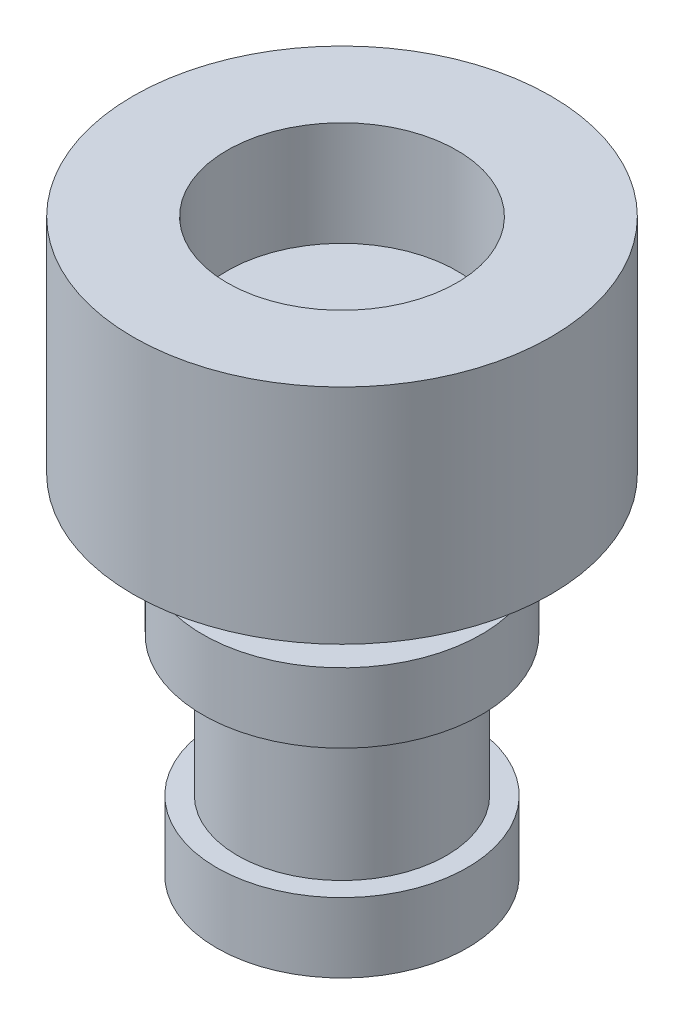
ISO-10303-21;
HEADER;
FILE_DESCRIPTION(('STEP AP214'),'2;1');
FILE_NAME('part.step','',(''),(''),'','','');
FILE_SCHEMA(('AUTOMOTIVE_DESIGN { 1 0 10303 214 1 1 1 1 }'));
ENDSEC;
DATA;
#1=APPLICATION_CONTEXT('core data for automotive mechanical design processes');
#2=APPLICATION_PROTOCOL_DEFINITION('international standard','automotive_design',2000,#1);
#3=PRODUCT_CONTEXT('',#1,'mechanical');
#4=PRODUCT('Part','Part','',(#3));
#5=PRODUCT_RELATED_PRODUCT_CATEGORY('part','',(#4));
#6=PRODUCT_DEFINITION_FORMATION('','',#4);
#7=PRODUCT_DEFINITION_CONTEXT('part definition',#1,'design');
#8=PRODUCT_DEFINITION('design','',#6,#7);
#9=PRODUCT_DEFINITION_SHAPE('','',#8);
#10=(LENGTH_UNIT() NAMED_UNIT(*) SI_UNIT(.MILLI.,.METRE.));
#11=(NAMED_UNIT(*) PLANE_ANGLE_UNIT() SI_UNIT($,.RADIAN.));
#12=(NAMED_UNIT(*) SI_UNIT($,.STERADIAN.) SOLID_ANGLE_UNIT());
#13=UNCERTAINTY_MEASURE_WITH_UNIT(LENGTH_MEASURE(1.E-05),#10,'distance_accuracy_value','');
#14=(GEOMETRIC_REPRESENTATION_CONTEXT(3) GLOBAL_UNCERTAINTY_ASSIGNED_CONTEXT((#13)) GLOBAL_UNIT_ASSIGNED_CONTEXT((#10,
#11,#12)) REPRESENTATION_CONTEXT('',''));
#15=CARTESIAN_POINT('',(0.,0.,0.));
#16=DIRECTION('',(0.,0.,1.));
#17=DIRECTION('',(1.,0.,0.));
#18=AXIS2_PLACEMENT_3D('',#15,#16,#17);
#19=CARTESIAN_POINT('',(-0.522013311509166,-5.,-0.51113803418606));
#20=DIRECTION('',(0.,1.,0.));
#21=DIRECTION('',(0.,0.,1.));
#22=AXIS2_PLACEMENT_3D('',#19,#20,#21);
#23=CYLINDRICAL_SURFACE('',#22,1.5);
#24=CARTESIAN_POINT('',(-0.522013311509166,-2.,-0.51113803418606));
#25=DIRECTION('',(0.,-1.,0.));
#26=DIRECTION('',(0.,0.,-1.));
#27=AXIS2_PLACEMENT_3D('',#24,#25,#26);
#28=CIRCLE('',#27,1.5);
#29=CARTESIAN_POINT('',(-0.522013311509166,-2.,-2.01113803418606));
#30=VERTEX_POINT('',#29);
#31=EDGE_CURVE('E53',#30,#30,#28,.T.);
#32=ORIENTED_EDGE('',*,*,#31,.T.);
#33=EDGE_LOOP('',(#32));
#34=FACE_BOUND('',#33,.T.);
#35=CARTESIAN_POINT('',(-0.522013311509166,-4.,-0.51113803418606));
#36=DIRECTION('',(0.,-1.,0.));
#37=DIRECTION('',(0.,0.,-1.));
#38=AXIS2_PLACEMENT_3D('',#35,#36,#37);
#39=CIRCLE('',#38,1.5);
#40=CARTESIAN_POINT('',(-0.522013311509166,-4.,-2.01113803418606));
#41=VERTEX_POINT('',#40);
#42=EDGE_CURVE('E10',#41,#41,#39,.T.);
#43=ORIENTED_EDGE('',*,*,#42,.F.);
#44=EDGE_LOOP('',(#43));
#45=FACE_BOUND('',#44,.T.);
#46=ADVANCED_FACE('F45',(#34,#45),#23,.T.);
#47=CARTESIAN_POINT('',(-0.522013311509166,3.2,-0.51113803418606));
#48=DIRECTION('',(0.,-1.,0.));
#49=DIRECTION('',(0.,0.,-1.));
#50=AXIS2_PLACEMENT_3D('',#47,#48,#49);
#51=CYLINDRICAL_SURFACE('',#50,3.);
#52=CARTESIAN_POINT('',(-0.522013311509166,3.2,-0.51113803418606));
#53=DIRECTION('',(0.,1.,0.));
#54=DIRECTION('',(0.,0.,1.));
#55=AXIS2_PLACEMENT_3D('',#52,#53,#54);
#56=CIRCLE('',#55,3.);
#57=CARTESIAN_POINT('',(-0.522013311509166,3.2,2.48886196581394));
#58=VERTEX_POINT('',#57);
#59=EDGE_CURVE('E64',#58,#58,#56,.T.);
#60=ORIENTED_EDGE('',*,*,#59,.F.);
#61=EDGE_LOOP('',(#60));
#62=FACE_BOUND('',#61,.T.);
#63=CARTESIAN_POINT('',(-0.522013311509166,0.,-0.51113803418606));
#64=DIRECTION('',(0.,1.,0.));
#65=DIRECTION('',(0.,0.,1.));
#66=AXIS2_PLACEMENT_3D('',#63,#64,#65);
#67=CIRCLE('',#66,3.);
#68=CARTESIAN_POINT('',(-0.522013311509166,0.,2.48886196581394));
#69=VERTEX_POINT('',#68);
#70=EDGE_CURVE('E82',#69,#69,#67,.T.);
#71=ORIENTED_EDGE('',*,*,#70,.T.);
#72=EDGE_LOOP('',(#71));
#73=FACE_BOUND('',#72,.T.);
#74=ADVANCED_FACE('F47',(#62,#73),#51,.T.);
#75=CARTESIAN_POINT('',(-0.522013311509166,3.2,-0.51113803418606));
#76=DIRECTION('',(0.,1.,0.));
#77=DIRECTION('',(0.,0.,1.));
#78=AXIS2_PLACEMENT_3D('',#75,#76,#77);
#79=PLANE('',#78);
#80=CARTESIAN_POINT('',(-0.522013311509166,3.2,-0.51113803418606));
#81=DIRECTION('',(0.,1.,0.));
#82=DIRECTION('',(0.,0.,1.));
#83=AXIS2_PLACEMENT_3D('',#80,#81,#82);
#84=CIRCLE('',#83,1.65);
#85=CARTESIAN_POINT('',(-0.522013311509166,3.2,1.13886196581394));
#86=VERTEX_POINT('',#85);
#87=EDGE_CURVE('E255',#86,#86,#84,.T.);
#88=ORIENTED_EDGE('',*,*,#87,.F.);
#89=EDGE_LOOP('',(#88));
#90=FACE_BOUND('',#89,.T.);
#91=ORIENTED_EDGE('',*,*,#59,.T.);
#92=EDGE_LOOP('',(#91));
#93=FACE_BOUND('',#92,.T.);
#94=ADVANCED_FACE('F94',(#90,#93),#79,.T.);
#95=CARTESIAN_POINT('',(-0.522013311509166,0.,-0.51113803418606));
#96=DIRECTION('',(0.,1.,0.));
#97=DIRECTION('',(0.,0.,1.));
#98=AXIS2_PLACEMENT_3D('',#95,#96,#97);
#99=PLANE('',#98);
#100=CARTESIAN_POINT('',(-0.522013311509166,0.,-0.51113803418606));
#101=DIRECTION('',(0.,-1.,0.));
#102=DIRECTION('',(0.,0.,-1.));
#103=AXIS2_PLACEMENT_3D('',#100,#101,#102);
#104=CIRCLE('',#103,1.5);
#105=CARTESIAN_POINT('',(-0.522013311509166,0.,-2.01113803418606));
#106=VERTEX_POINT('',#105);
#107=EDGE_CURVE('E58',#106,#106,#104,.T.);
#108=ORIENTED_EDGE('',*,*,#107,.F.);
#109=EDGE_LOOP('',(#108));
#110=FACE_BOUND('',#109,.T.);
#111=ORIENTED_EDGE('',*,*,#70,.F.);
#112=EDGE_LOOP('',(#111));
#113=FACE_BOUND('',#112,.T.);
#114=ADVANCED_FACE('F91',(#110,#113),#99,.F.);
#115=CARTESIAN_POINT('',(-0.522013311509166,-1.,-0.51113803418606));
#116=DIRECTION('',(0.,1.,0.));
#117=DIRECTION('',(0.,0.,1.));
#118=AXIS2_PLACEMENT_3D('',#115,#116,#117);
#119=CYLINDRICAL_SURFACE('',#118,1.5);
#120=CARTESIAN_POINT('',(-0.522013311509166,-1.,-0.51113803418606));
#121=DIRECTION('',(0.,-1.,0.));
#122=DIRECTION('',(0.,0.,-1.));
#123=AXIS2_PLACEMENT_3D('',#120,#121,#122);
#124=CIRCLE('',#123,1.5);
#125=CARTESIAN_POINT('',(-0.522013311509166,-1.,-2.01113803418606));
#126=VERTEX_POINT('',#125);
#127=EDGE_CURVE('E74',#126,#126,#124,.T.);
#128=ORIENTED_EDGE('',*,*,#127,.F.);
#129=EDGE_LOOP('',(#128));
#130=FACE_BOUND('',#129,.T.);
#131=ORIENTED_EDGE('',*,*,#107,.T.);
#132=EDGE_LOOP('',(#131));
#133=FACE_BOUND('',#132,.T.);
#134=ADVANCED_FACE('F93',(#130,#133),#119,.T.);
#135=CARTESIAN_POINT('',(-0.522013311509166,-2.,-0.51113803418606));
#136=DIRECTION('',(0.,1.,0.));
#137=DIRECTION('',(0.,0.,1.));
#138=AXIS2_PLACEMENT_3D('',#135,#136,#137);
#139=CYLINDRICAL_SURFACE('',#138,2.);
#140=CARTESIAN_POINT('',(-0.522013311509166,-2.,-0.51113803418606));
#141=DIRECTION('',(0.,-1.,0.));
#142=DIRECTION('',(0.,0.,-1.));
#143=AXIS2_PLACEMENT_3D('',#140,#141,#142);
#144=CIRCLE('',#143,2.);
#145=CARTESIAN_POINT('',(-0.522013311509166,-2.,-2.51113803418606));
#146=VERTEX_POINT('',#145);
#147=EDGE_CURVE('E70',#146,#146,#144,.T.);
#148=ORIENTED_EDGE('',*,*,#147,.F.);
#149=EDGE_LOOP('',(#148));
#150=FACE_BOUND('',#149,.T.);
#151=CARTESIAN_POINT('',(-0.522013311509166,-1.,-0.51113803418606));
#152=DIRECTION('',(0.,-1.,0.));
#153=DIRECTION('',(0.,0.,-1.));
#154=AXIS2_PLACEMENT_3D('',#151,#152,#153);
#155=CIRCLE('',#154,2.);
#156=CARTESIAN_POINT('',(-0.522013311509166,-1.,-2.51113803418606));
#157=VERTEX_POINT('',#156);
#158=EDGE_CURVE('E75',#157,#157,#155,.T.);
#159=ORIENTED_EDGE('',*,*,#158,.T.);
#160=EDGE_LOOP('',(#159));
#161=FACE_BOUND('',#160,.T.);
#162=ADVANCED_FACE('F100',(#150,#161),#139,.T.);
#163=CARTESIAN_POINT('',(-0.522013311509166,-2.,-0.51113803418606));
#164=DIRECTION('',(0.,-1.,0.));
#165=DIRECTION('',(0.,0.,-1.));
#166=AXIS2_PLACEMENT_3D('',#163,#164,#165);
#167=PLANE('',#166);
#168=ORIENTED_EDGE('',*,*,#31,.F.);
#169=EDGE_LOOP('',(#168));
#170=FACE_BOUND('',#169,.T.);
#171=ORIENTED_EDGE('',*,*,#147,.T.);
#172=EDGE_LOOP('',(#171));
#173=FACE_BOUND('',#172,.T.);
#174=ADVANCED_FACE('F117',(#170,#173),#167,.T.);
#175=CARTESIAN_POINT('',(-0.522013311509166,-1.,-0.51113803418606));
#176=DIRECTION('',(0.,-1.,0.));
#177=DIRECTION('',(0.,0.,-1.));
#178=AXIS2_PLACEMENT_3D('',#175,#176,#177);
#179=PLANE('',#178);
#180=ORIENTED_EDGE('',*,*,#127,.T.);
#181=EDGE_LOOP('',(#180));
#182=FACE_BOUND('',#181,.T.);
#183=ORIENTED_EDGE('',*,*,#158,.F.);
#184=EDGE_LOOP('',(#183));
#185=FACE_BOUND('',#184,.T.);
#186=ADVANCED_FACE('F120',(#182,#185),#179,.F.);
#187=CARTESIAN_POINT('',(-0.522013311509166,-4.,-0.51113803418606));
#188=DIRECTION('',(0.,-1.,0.));
#189=DIRECTION('',(0.,0.,-1.));
#190=AXIS2_PLACEMENT_3D('',#187,#188,#189);
#191=CYLINDRICAL_SURFACE('',#190,1.8);
#192=CARTESIAN_POINT('',(-0.522013311509166,-4.,-0.51113803418606));
#193=DIRECTION('',(0.,-1.,0.));
#194=DIRECTION('',(0.,0.,-1.));
#195=AXIS2_PLACEMENT_3D('',#192,#193,#194);
#196=CIRCLE('',#195,1.8);
#197=CARTESIAN_POINT('',(-0.522013311509166,-4.,-2.31113803418606));
#198=VERTEX_POINT('',#197);
#199=EDGE_CURVE('E79',#198,#198,#196,.T.);
#200=ORIENTED_EDGE('',*,*,#199,.T.);
#201=EDGE_LOOP('',(#200));
#202=FACE_BOUND('',#201,.T.);
#203=CARTESIAN_POINT('',(-0.522013311509166,-5.,-0.51113803418606));
#204=DIRECTION('',(0.,-1.,0.));
#205=DIRECTION('',(0.,0.,-1.));
#206=AXIS2_PLACEMENT_3D('',#203,#204,#205);
#207=CIRCLE('',#206,1.8);
#208=CARTESIAN_POINT('',(-0.522013311509166,-5.,-2.31113803418606));
#209=VERTEX_POINT('',#208);
#210=EDGE_CURVE('E68',#209,#209,#207,.T.);
#211=ORIENTED_EDGE('',*,*,#210,.F.);
#212=EDGE_LOOP('',(#211));
#213=FACE_BOUND('',#212,.T.);
#214=ADVANCED_FACE('F124',(#202,#213),#191,.T.);
#215=CARTESIAN_POINT('',(-0.522013311509166,-4.,-0.51113803418606));
#216=DIRECTION('',(0.,-1.,0.));
#217=DIRECTION('',(0.,0.,-1.));
#218=AXIS2_PLACEMENT_3D('',#215,#216,#217);
#219=PLANE('',#218);
#220=ORIENTED_EDGE('',*,*,#42,.T.);
#221=EDGE_LOOP('',(#220));
#222=FACE_BOUND('',#221,.T.);
#223=ORIENTED_EDGE('',*,*,#199,.F.);
#224=EDGE_LOOP('',(#223));
#225=FACE_BOUND('',#224,.T.);
#226=ADVANCED_FACE('F151',(#222,#225),#219,.F.);
#227=CARTESIAN_POINT('',(-0.522013311509166,-5.,-0.51113803418606));
#228=DIRECTION('',(0.,-1.,0.));
#229=DIRECTION('',(0.,0.,-1.));
#230=AXIS2_PLACEMENT_3D('',#227,#228,#229);
#231=PLANE('',#230);
#232=ORIENTED_EDGE('',*,*,#210,.T.);
#233=EDGE_LOOP('',(#232));
#234=FACE_BOUND('',#233,.T.);
#235=ADVANCED_FACE('F115',(#234),#231,.T.);
#236=CARTESIAN_POINT('',(-0.522013311509166,1.7,-0.51113803418606));
#237=DIRECTION('',(0.,1.,0.));
#238=DIRECTION('',(0.,0.,1.));
#239=AXIS2_PLACEMENT_3D('',#236,#237,#238);
#240=CYLINDRICAL_SURFACE('',#239,1.65);
#241=CARTESIAN_POINT('',(-0.522013311509166,1.7,-0.51113803418606));
#242=DIRECTION('',(0.,1.,0.));
#243=DIRECTION('',(0.,0.,1.));
#244=AXIS2_PLACEMENT_3D('',#241,#242,#243);
#245=CIRCLE('',#244,1.65);
#246=CARTESIAN_POINT('',(-0.522013311509166,1.7,1.13886196581394));
#247=VERTEX_POINT('',#246);
#248=EDGE_CURVE('E253',#247,#247,#245,.T.);
#249=ORIENTED_EDGE('',*,*,#248,.F.);
#250=EDGE_LOOP('',(#249));
#251=FACE_BOUND('',#250,.T.);
#252=ORIENTED_EDGE('',*,*,#87,.T.);
#253=EDGE_LOOP('',(#252));
#254=FACE_BOUND('',#253,.T.);
#255=ADVANCED_FACE('F164',(#251,#254),#240,.F.);
#256=CARTESIAN_POINT('',(-0.522013311509166,1.7,-0.51113803418606));
#257=DIRECTION('',(0.,1.,0.));
#258=DIRECTION('',(0.,0.,1.));
#259=AXIS2_PLACEMENT_3D('',#256,#257,#258);
#260=PLANE('',#259);
#261=ORIENTED_EDGE('',*,*,#248,.T.);
#262=EDGE_LOOP('',(#261));
#263=FACE_BOUND('',#262,.T.);
#264=ADVANCED_FACE('F172',(#263),#260,.T.);
#265=CLOSED_SHELL('',(#46,#74,#94,#114,#134,#162,#174,#186,#214,#226,#235,#255,#264));
#266=MANIFOLD_SOLID_BREP('B2',#265);
#267=ADVANCED_BREP_SHAPE_REPRESENTATION('',(#18,#266),#14);
#268=SHAPE_DEFINITION_REPRESENTATION(#9,#267);
ENDSEC;
END-ISO-10303-21;
